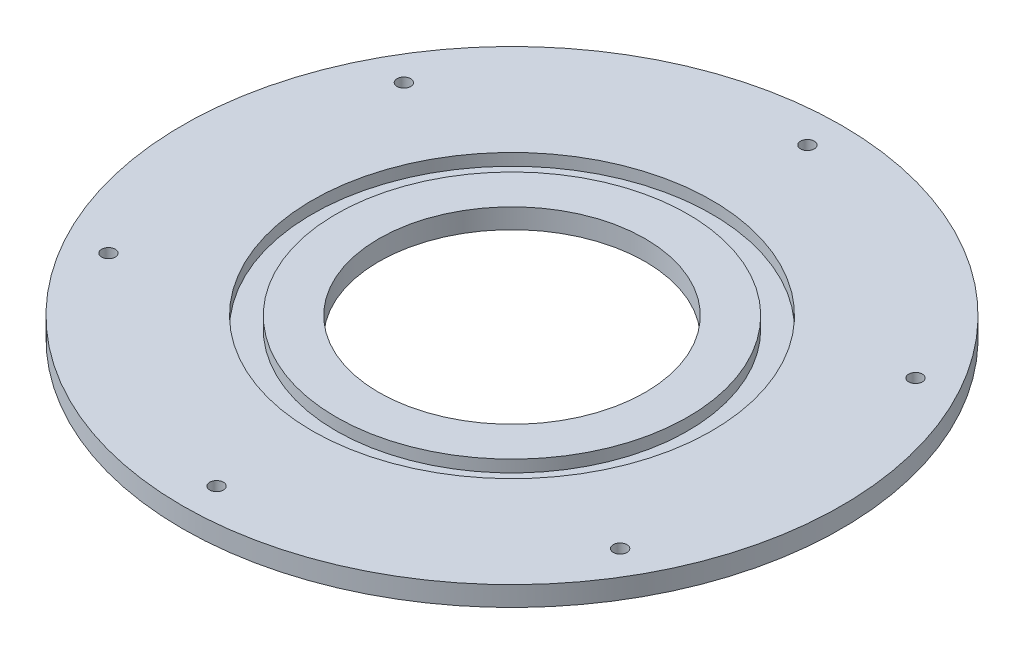
ISO-10303-21;
HEADER;
FILE_DESCRIPTION(('STEP AP214'),'2;1');
FILE_NAME('part.step','',(''),(''),'','','');
FILE_SCHEMA(('AUTOMOTIVE_DESIGN { 1 0 10303 214 1 1 1 1 }'));
ENDSEC;
DATA;
#1=APPLICATION_CONTEXT('core data for automotive mechanical design processes');
#2=APPLICATION_PROTOCOL_DEFINITION('international standard','automotive_design',2000,#1);
#3=PRODUCT_CONTEXT('',#1,'mechanical');
#4=PRODUCT('Part','Part','',(#3));
#5=PRODUCT_RELATED_PRODUCT_CATEGORY('part','',(#4));
#6=PRODUCT_DEFINITION_FORMATION('','',#4);
#7=PRODUCT_DEFINITION_CONTEXT('part definition',#1,'design');
#8=PRODUCT_DEFINITION('design','',#6,#7);
#9=PRODUCT_DEFINITION_SHAPE('','',#8);
#10=(LENGTH_UNIT() NAMED_UNIT(*) SI_UNIT(.MILLI.,.METRE.));
#11=(NAMED_UNIT(*) PLANE_ANGLE_UNIT() SI_UNIT($,.RADIAN.));
#12=(NAMED_UNIT(*) SI_UNIT($,.STERADIAN.) SOLID_ANGLE_UNIT());
#13=UNCERTAINTY_MEASURE_WITH_UNIT(LENGTH_MEASURE(1.E-05),#10,'distance_accuracy_value','');
#14=(GEOMETRIC_REPRESENTATION_CONTEXT(3) GLOBAL_UNCERTAINTY_ASSIGNED_CONTEXT((#13)) GLOBAL_UNIT_ASSIGNED_CONTEXT((#10,
#11,#12)) REPRESENTATION_CONTEXT('',''));
#15=CARTESIAN_POINT('',(0.,0.,0.));
#16=DIRECTION('',(0.,0.,1.));
#17=DIRECTION('',(1.,0.,0.));
#18=AXIS2_PLACEMENT_3D('',#15,#16,#17);
#19=CARTESIAN_POINT('',(0.,5.8,0.));
#20=DIRECTION('',(0.,1.,0.));
#21=DIRECTION('',(0.,0.,1.));
#22=AXIS2_PLACEMENT_3D('',#19,#20,#21);
#23=PLANE('',#22);
#24=CARTESIAN_POINT('',(0.,5.8,0.));
#25=DIRECTION('',(0.,1.,0.));
#26=DIRECTION('',(0.,0.,1.));
#27=AXIS2_PLACEMENT_3D('',#24,#25,#26);
#28=CIRCLE('',#27,39.);
#29=CARTESIAN_POINT('',(0.,5.8,39.));
#30=VERTEX_POINT('',#29);
#31=EDGE_CURVE('E45',#30,#30,#28,.T.);
#32=ORIENTED_EDGE('',*,*,#31,.F.);
#33=EDGE_LOOP('',(#32));
#34=FACE_BOUND('',#33,.T.);
#35=CARTESIAN_POINT('',(0.,5.8,0.));
#36=DIRECTION('',(0.,1.,0.));
#37=DIRECTION('',(0.,0.,1.));
#38=AXIS2_PLACEMENT_3D('',#35,#36,#37);
#39=CIRCLE('',#38,51.5);
#40=CARTESIAN_POINT('',(0.,5.8,51.5));
#41=VERTEX_POINT('',#40);
#42=EDGE_CURVE('E59',#41,#41,#39,.T.);
#43=ORIENTED_EDGE('',*,*,#42,.T.);
#44=EDGE_LOOP('',(#43));
#45=FACE_BOUND('',#44,.T.);
#46=ADVANCED_FACE('F34',(#34,#45),#23,.T.);
#47=CARTESIAN_POINT('',(0.,5.8,-86.5));
#48=DIRECTION('',(0.,1.,0.));
#49=DIRECTION('',(0.,0.,1.));
#50=AXIS2_PLACEMENT_3D('',#47,#48,#49);
#51=CIRCLE('',#50,2.);
#52=CARTESIAN_POINT('',(0.,5.8,-84.5));
#53=VERTEX_POINT('',#52);
#54=EDGE_CURVE('E90',#53,#53,#51,.T.);
#55=ORIENTED_EDGE('',*,*,#54,.F.);
#56=EDGE_LOOP('',(#55));
#57=FACE_BOUND('',#56,.T.);
#58=CARTESIAN_POINT('',(-74.9111974273528,5.8,-43.2499999999979));
#59=DIRECTION('',(0.,1.,0.));
#60=DIRECTION('',(0.,0.,1.));
#61=AXIS2_PLACEMENT_3D('',#58,#59,#60);
#62=CIRCLE('',#61,2.);
#63=CARTESIAN_POINT('',(-74.9111974273528,5.8,-41.2499999999979));
#64=VERTEX_POINT('',#63);
#65=EDGE_CURVE('E91',#64,#64,#62,.T.);
#66=ORIENTED_EDGE('',*,*,#65,.F.);
#67=EDGE_LOOP('',(#66));
#68=FACE_BOUND('',#67,.T.);
#69=CARTESIAN_POINT('',(-74.9111974273503,5.8,43.2500000000021));
#70=DIRECTION('',(0.,1.,0.));
#71=DIRECTION('',(0.,0.,1.));
#72=AXIS2_PLACEMENT_3D('',#69,#70,#71);
#73=CIRCLE('',#72,2.);
#74=CARTESIAN_POINT('',(-74.9111974273503,5.8,45.2500000000021));
#75=VERTEX_POINT('',#74);
#76=EDGE_CURVE('E65',#75,#75,#73,.T.);
#77=ORIENTED_EDGE('',*,*,#76,.F.);
#78=EDGE_LOOP('',(#77));
#79=FACE_BOUND('',#78,.T.);
#80=CARTESIAN_POINT('',(4.82666955129218E-12,5.8,86.5));
#81=DIRECTION('',(0.,1.,0.));
#82=DIRECTION('',(0.,0.,1.));
#83=AXIS2_PLACEMENT_3D('',#80,#81,#82);
#84=CIRCLE('',#83,2.);
#85=CARTESIAN_POINT('',(4.82666955129218E-12,5.8,88.5));
#86=VERTEX_POINT('',#85);
#87=EDGE_CURVE('E72',#86,#86,#84,.T.);
#88=ORIENTED_EDGE('',*,*,#87,.F.);
#89=EDGE_LOOP('',(#88));
#90=FACE_BOUND('',#89,.T.);
#91=CARTESIAN_POINT('',(74.9111974273576,5.8,43.2499999999979));
#92=DIRECTION('',(0.,1.,0.));
#93=DIRECTION('',(0.,0.,1.));
#94=AXIS2_PLACEMENT_3D('',#91,#92,#93);
#95=CIRCLE('',#94,2.);
#96=CARTESIAN_POINT('',(74.9111974273576,5.8,45.2499999999979));
#97=VERTEX_POINT('',#96);
#98=EDGE_CURVE('E78',#97,#97,#95,.T.);
#99=ORIENTED_EDGE('',*,*,#98,.F.);
#100=EDGE_LOOP('',(#99));
#101=FACE_BOUND('',#100,.T.);
#102=CARTESIAN_POINT('',(74.9111974273551,5.8,-43.2500000000021));
#103=DIRECTION('',(0.,1.,0.));
#104=DIRECTION('',(0.,0.,1.));
#105=AXIS2_PLACEMENT_3D('',#102,#103,#104);
#106=CIRCLE('',#105,2.);
#107=CARTESIAN_POINT('',(74.9111974273551,5.8,-41.2500000000021));
#108=VERTEX_POINT('',#107);
#109=EDGE_CURVE('E84',#108,#108,#106,.T.);
#110=ORIENTED_EDGE('',*,*,#109,.F.);
#111=EDGE_LOOP('',(#110));
#112=FACE_BOUND('',#111,.T.);
#113=CARTESIAN_POINT('',(0.,5.8,0.));
#114=DIRECTION('',(0.,1.,0.));
#115=DIRECTION('',(0.,0.,1.));
#116=AXIS2_PLACEMENT_3D('',#113,#114,#115);
#117=CIRCLE('',#116,58.5);
#118=CARTESIAN_POINT('',(0.,5.8,58.5));
#119=VERTEX_POINT('',#118);
#120=EDGE_CURVE('E53',#119,#119,#117,.T.);
#121=ORIENTED_EDGE('',*,*,#120,.F.);
#122=EDGE_LOOP('',(#121));
#123=FACE_BOUND('',#122,.T.);
#124=CARTESIAN_POINT('',(0.,5.8,0.));
#125=DIRECTION('',(0.,1.,0.));
#126=DIRECTION('',(0.,0.,1.));
#127=AXIS2_PLACEMENT_3D('',#124,#125,#126);
#128=CIRCLE('',#127,96.5);
#129=CARTESIAN_POINT('',(0.,5.8,96.5));
#130=VERTEX_POINT('',#129);
#131=EDGE_CURVE('E10',#130,#130,#128,.T.);
#132=ORIENTED_EDGE('',*,*,#131,.T.);
#133=EDGE_LOOP('',(#132));
#134=FACE_BOUND('',#133,.T.);
#135=ADVANCED_FACE('F111',(#57,#68,#79,#90,#101,#112,#123,#134),#23,.T.);
#136=CARTESIAN_POINT('',(0.,0.,0.));
#137=DIRECTION('',(0.,1.,0.));
#138=DIRECTION('',(0.,0.,1.));
#139=AXIS2_PLACEMENT_3D('',#136,#137,#138);
#140=PLANE('',#139);
#141=CARTESIAN_POINT('',(0.,0.,-86.5));
#142=DIRECTION('',(0.,1.,0.));
#143=DIRECTION('',(0.,0.,1.));
#144=AXIS2_PLACEMENT_3D('',#141,#142,#143);
#145=CIRCLE('',#144,2.);
#146=CARTESIAN_POINT('',(0.,0.,-84.5));
#147=VERTEX_POINT('',#146);
#148=EDGE_CURVE('E62',#147,#147,#145,.T.);
#149=ORIENTED_EDGE('',*,*,#148,.T.);
#150=EDGE_LOOP('',(#149));
#151=FACE_BOUND('',#150,.T.);
#152=CARTESIAN_POINT('',(-74.9111974273528,0.,-43.2499999999979));
#153=DIRECTION('',(0.,1.,0.));
#154=DIRECTION('',(0.,0.,1.));
#155=AXIS2_PLACEMENT_3D('',#152,#153,#154);
#156=CIRCLE('',#155,2.);
#157=CARTESIAN_POINT('',(-74.9111974273528,0.,-41.2499999999979));
#158=VERTEX_POINT('',#157);
#159=EDGE_CURVE('E69',#158,#158,#156,.T.);
#160=ORIENTED_EDGE('',*,*,#159,.T.);
#161=EDGE_LOOP('',(#160));
#162=FACE_BOUND('',#161,.T.);
#163=CARTESIAN_POINT('',(-74.9111974273503,0.,43.2500000000021));
#164=DIRECTION('',(0.,1.,0.));
#165=DIRECTION('',(0.,0.,1.));
#166=AXIS2_PLACEMENT_3D('',#163,#164,#165);
#167=CIRCLE('',#166,2.);
#168=CARTESIAN_POINT('',(-74.9111974273503,0.,45.2500000000021));
#169=VERTEX_POINT('',#168);
#170=EDGE_CURVE('E68',#169,#169,#167,.T.);
#171=ORIENTED_EDGE('',*,*,#170,.T.);
#172=EDGE_LOOP('',(#171));
#173=FACE_BOUND('',#172,.T.);
#174=CARTESIAN_POINT('',(4.82666955129218E-12,0.,86.5));
#175=DIRECTION('',(0.,1.,0.));
#176=DIRECTION('',(0.,0.,1.));
#177=AXIS2_PLACEMENT_3D('',#174,#175,#176);
#178=CIRCLE('',#177,2.);
#179=CARTESIAN_POINT('',(4.82666955129218E-12,0.,88.5));
#180=VERTEX_POINT('',#179);
#181=EDGE_CURVE('E75',#180,#180,#178,.T.);
#182=ORIENTED_EDGE('',*,*,#181,.T.);
#183=EDGE_LOOP('',(#182));
#184=FACE_BOUND('',#183,.T.);
#185=CARTESIAN_POINT('',(74.9111974273576,0.,43.2499999999979));
#186=DIRECTION('',(0.,1.,0.));
#187=DIRECTION('',(0.,0.,1.));
#188=AXIS2_PLACEMENT_3D('',#185,#186,#187);
#189=CIRCLE('',#188,2.);
#190=CARTESIAN_POINT('',(74.9111974273576,0.,45.2499999999979));
#191=VERTEX_POINT('',#190);
#192=EDGE_CURVE('E81',#191,#191,#189,.T.);
#193=ORIENTED_EDGE('',*,*,#192,.T.);
#194=EDGE_LOOP('',(#193));
#195=FACE_BOUND('',#194,.T.);
#196=CARTESIAN_POINT('',(74.9111974273551,0.,-43.2500000000021));
#197=DIRECTION('',(0.,1.,0.));
#198=DIRECTION('',(0.,0.,1.));
#199=AXIS2_PLACEMENT_3D('',#196,#197,#198);
#200=CIRCLE('',#199,2.);
#201=CARTESIAN_POINT('',(74.9111974273551,0.,-41.2500000000021));
#202=VERTEX_POINT('',#201);
#203=EDGE_CURVE('E87',#202,#202,#200,.T.);
#204=ORIENTED_EDGE('',*,*,#203,.T.);
#205=EDGE_LOOP('',(#204));
#206=FACE_BOUND('',#205,.T.);
#207=CARTESIAN_POINT('',(0.,0.,0.));
#208=DIRECTION('',(0.,1.,0.));
#209=DIRECTION('',(0.,0.,1.));
#210=AXIS2_PLACEMENT_3D('',#207,#208,#209);
#211=CIRCLE('',#210,96.5);
#212=CARTESIAN_POINT('',(0.,0.,96.5));
#213=VERTEX_POINT('',#212);
#214=EDGE_CURVE('E38',#213,#213,#211,.T.);
#215=ORIENTED_EDGE('',*,*,#214,.F.);
#216=EDGE_LOOP('',(#215));
#217=FACE_BOUND('',#216,.T.);
#218=CARTESIAN_POINT('',(0.,0.,0.));
#219=DIRECTION('',(0.,1.,0.));
#220=DIRECTION('',(0.,0.,1.));
#221=AXIS2_PLACEMENT_3D('',#218,#219,#220);
#222=CIRCLE('',#221,39.);
#223=CARTESIAN_POINT('',(0.,0.,39.));
#224=VERTEX_POINT('',#223);
#225=EDGE_CURVE('E47',#224,#224,#222,.T.);
#226=ORIENTED_EDGE('',*,*,#225,.T.);
#227=EDGE_LOOP('',(#226));
#228=FACE_BOUND('',#227,.T.);
#229=ADVANCED_FACE('F101',(#151,#162,#173,#184,#195,#206,#217,#228),#140,.F.);
#230=CARTESIAN_POINT('',(0.,5.8,0.));
#231=DIRECTION('',(0.,-1.,0.));
#232=DIRECTION('',(0.,0.,-1.));
#233=AXIS2_PLACEMENT_3D('',#230,#231,#232);
#234=CYLINDRICAL_SURFACE('',#233,96.5);
#235=ORIENTED_EDGE('',*,*,#131,.F.);
#236=EDGE_LOOP('',(#235));
#237=FACE_BOUND('',#236,.T.);
#238=ORIENTED_EDGE('',*,*,#214,.T.);
#239=EDGE_LOOP('',(#238));
#240=FACE_BOUND('',#239,.T.);
#241=ADVANCED_FACE('F36',(#237,#240),#234,.T.);
#242=CARTESIAN_POINT('',(0.,5.8,0.));
#243=DIRECTION('',(0.,-1.,0.));
#244=DIRECTION('',(0.,0.,-1.));
#245=AXIS2_PLACEMENT_3D('',#242,#243,#244);
#246=CYLINDRICAL_SURFACE('',#245,39.);
#247=ORIENTED_EDGE('',*,*,#31,.T.);
#248=EDGE_LOOP('',(#247));
#249=FACE_BOUND('',#248,.T.);
#250=ORIENTED_EDGE('',*,*,#225,.F.);
#251=EDGE_LOOP('',(#250));
#252=FACE_BOUND('',#251,.T.);
#253=ADVANCED_FACE('F130',(#249,#252),#246,.F.);
#254=CARTESIAN_POINT('',(0.,2.3,0.));
#255=DIRECTION('',(0.,1.,0.));
#256=DIRECTION('',(0.,0.,1.));
#257=AXIS2_PLACEMENT_3D('',#254,#255,#256);
#258=CYLINDRICAL_SURFACE('',#257,58.5);
#259=CARTESIAN_POINT('',(0.,2.3,0.));
#260=DIRECTION('',(0.,1.,0.));
#261=DIRECTION('',(0.,0.,1.));
#262=AXIS2_PLACEMENT_3D('',#259,#260,#261);
#263=CIRCLE('',#262,58.5);
#264=CARTESIAN_POINT('',(0.,2.3,58.5));
#265=VERTEX_POINT('',#264);
#266=EDGE_CURVE('E50',#265,#265,#263,.T.);
#267=ORIENTED_EDGE('',*,*,#266,.F.);
#268=EDGE_LOOP('',(#267));
#269=FACE_BOUND('',#268,.T.);
#270=ORIENTED_EDGE('',*,*,#120,.T.);
#271=EDGE_LOOP('',(#270));
#272=FACE_BOUND('',#271,.T.);
#273=ADVANCED_FACE('F127',(#269,#272),#258,.F.);
#274=CARTESIAN_POINT('',(0.,2.3,0.));
#275=DIRECTION('',(0.,1.,0.));
#276=DIRECTION('',(0.,0.,1.));
#277=AXIS2_PLACEMENT_3D('',#274,#275,#276);
#278=PLANE('',#277);
#279=CARTESIAN_POINT('',(0.,2.3,0.));
#280=DIRECTION('',(0.,1.,0.));
#281=DIRECTION('',(0.,0.,1.));
#282=AXIS2_PLACEMENT_3D('',#279,#280,#281);
#283=CIRCLE('',#282,51.5);
#284=CARTESIAN_POINT('',(0.,2.3,51.5));
#285=VERTEX_POINT('',#284);
#286=EDGE_CURVE('E56',#285,#285,#283,.T.);
#287=ORIENTED_EDGE('',*,*,#286,.F.);
#288=EDGE_LOOP('',(#287));
#289=FACE_BOUND('',#288,.T.);
#290=ORIENTED_EDGE('',*,*,#266,.T.);
#291=EDGE_LOOP('',(#290));
#292=FACE_BOUND('',#291,.T.);
#293=ADVANCED_FACE('F129',(#289,#292),#278,.T.);
#294=CARTESIAN_POINT('',(0.,2.3,0.));
#295=DIRECTION('',(0.,1.,0.));
#296=DIRECTION('',(0.,0.,1.));
#297=AXIS2_PLACEMENT_3D('',#294,#295,#296);
#298=CYLINDRICAL_SURFACE('',#297,51.5);
#299=ORIENTED_EDGE('',*,*,#286,.T.);
#300=EDGE_LOOP('',(#299));
#301=FACE_BOUND('',#300,.T.);
#302=ORIENTED_EDGE('',*,*,#42,.F.);
#303=EDGE_LOOP('',(#302));
#304=FACE_BOUND('',#303,.T.);
#305=ADVANCED_FACE('F137',(#301,#304),#298,.T.);
#306=CARTESIAN_POINT('',(74.9111974273551,0.,-43.2500000000021));
#307=DIRECTION('',(0.,1.,0.));
#308=DIRECTION('',(0.,0.,1.));
#309=AXIS2_PLACEMENT_3D('',#306,#307,#308);
#310=CYLINDRICAL_SURFACE('',#309,2.);
#311=ORIENTED_EDGE('',*,*,#203,.F.);
#312=EDGE_LOOP('',(#311));
#313=FACE_BOUND('',#312,.T.);
#314=ORIENTED_EDGE('',*,*,#109,.T.);
#315=EDGE_LOOP('',(#314));
#316=FACE_BOUND('',#315,.T.);
#317=ADVANCED_FACE('F189',(#313,#316),#310,.F.);
#318=CARTESIAN_POINT('',(74.9111974273576,0.,43.2499999999979));
#319=DIRECTION('',(0.,1.,0.));
#320=DIRECTION('',(0.,0.,1.));
#321=AXIS2_PLACEMENT_3D('',#318,#319,#320);
#322=CYLINDRICAL_SURFACE('',#321,2.);
#323=ORIENTED_EDGE('',*,*,#192,.F.);
#324=EDGE_LOOP('',(#323));
#325=FACE_BOUND('',#324,.T.);
#326=ORIENTED_EDGE('',*,*,#98,.T.);
#327=EDGE_LOOP('',(#326));
#328=FACE_BOUND('',#327,.T.);
#329=ADVANCED_FACE('F209',(#325,#328),#322,.F.);
#330=CARTESIAN_POINT('',(4.82666955129218E-12,0.,86.5));
#331=DIRECTION('',(0.,1.,0.));
#332=DIRECTION('',(0.,0.,1.));
#333=AXIS2_PLACEMENT_3D('',#330,#331,#332);
#334=CYLINDRICAL_SURFACE('',#333,2.);
#335=ORIENTED_EDGE('',*,*,#181,.F.);
#336=EDGE_LOOP('',(#335));
#337=FACE_BOUND('',#336,.T.);
#338=ORIENTED_EDGE('',*,*,#87,.T.);
#339=EDGE_LOOP('',(#338));
#340=FACE_BOUND('',#339,.T.);
#341=ADVANCED_FACE('F219',(#337,#340),#334,.F.);
#342=CARTESIAN_POINT('',(-74.9111974273503,0.,43.2500000000021));
#343=DIRECTION('',(0.,1.,0.));
#344=DIRECTION('',(0.,0.,1.));
#345=AXIS2_PLACEMENT_3D('',#342,#343,#344);
#346=CYLINDRICAL_SURFACE('',#345,2.);
#347=ORIENTED_EDGE('',*,*,#170,.F.);
#348=EDGE_LOOP('',(#347));
#349=FACE_BOUND('',#348,.T.);
#350=ORIENTED_EDGE('',*,*,#76,.T.);
#351=EDGE_LOOP('',(#350));
#352=FACE_BOUND('',#351,.T.);
#353=ADVANCED_FACE('F229',(#349,#352),#346,.F.);
#354=CARTESIAN_POINT('',(-74.9111974273528,0.,-43.2499999999979));
#355=DIRECTION('',(0.,1.,0.));
#356=DIRECTION('',(0.,0.,1.));
#357=AXIS2_PLACEMENT_3D('',#354,#355,#356);
#358=CYLINDRICAL_SURFACE('',#357,2.);
#359=ORIENTED_EDGE('',*,*,#159,.F.);
#360=EDGE_LOOP('',(#359));
#361=FACE_BOUND('',#360,.T.);
#362=ORIENTED_EDGE('',*,*,#65,.T.);
#363=EDGE_LOOP('',(#362));
#364=FACE_BOUND('',#363,.T.);
#365=ADVANCED_FACE('F107',(#361,#364),#358,.F.);
#366=CARTESIAN_POINT('',(0.,0.,-86.5));
#367=DIRECTION('',(0.,1.,0.));
#368=DIRECTION('',(0.,0.,1.));
#369=AXIS2_PLACEMENT_3D('',#366,#367,#368);
#370=CYLINDRICAL_SURFACE('',#369,2.);
#371=ORIENTED_EDGE('',*,*,#148,.F.);
#372=EDGE_LOOP('',(#371));
#373=FACE_BOUND('',#372,.T.);
#374=ORIENTED_EDGE('',*,*,#54,.T.);
#375=EDGE_LOOP('',(#374));
#376=FACE_BOUND('',#375,.T.);
#377=ADVANCED_FACE('F104',(#373,#376),#370,.F.);
#378=CLOSED_SHELL('',(#46,#135,#229,#241,#253,#273,#293,#305,#317,#329,#341,#353,#365,#377));
#379=MANIFOLD_SOLID_BREP('B2',#378);
#380=ADVANCED_BREP_SHAPE_REPRESENTATION('',(#18,#379),#14);
#381=SHAPE_DEFINITION_REPRESENTATION(#9,#380);
ENDSEC;
END-ISO-10303-21;
